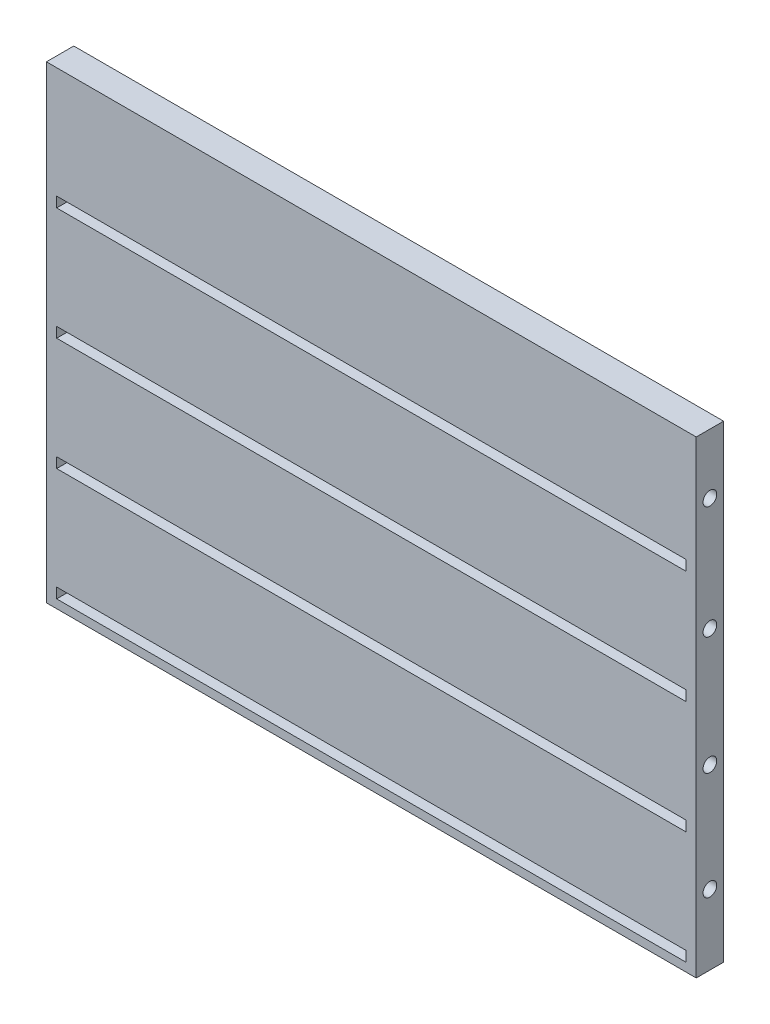
ISO-10303-21;
HEADER;
FILE_DESCRIPTION(('STEP AP214'),'2;1');
FILE_NAME('part.step','',(''),(''),'','','');
FILE_SCHEMA(('AUTOMOTIVE_DESIGN { 1 0 10303 214 1 1 1 1 }'));
ENDSEC;
DATA;
#1=APPLICATION_CONTEXT('core data for automotive mechanical design processes');
#2=APPLICATION_PROTOCOL_DEFINITION('international standard','automotive_design',2000,#1);
#3=PRODUCT_CONTEXT('',#1,'mechanical');
#4=PRODUCT('Part','Part','',(#3));
#5=PRODUCT_RELATED_PRODUCT_CATEGORY('part','',(#4));
#6=PRODUCT_DEFINITION_FORMATION('','',#4);
#7=PRODUCT_DEFINITION_CONTEXT('part definition',#1,'design');
#8=PRODUCT_DEFINITION('design','',#6,#7);
#9=PRODUCT_DEFINITION_SHAPE('','',#8);
#10=(LENGTH_UNIT() NAMED_UNIT(*) SI_UNIT(.MILLI.,.METRE.));
#11=(NAMED_UNIT(*) PLANE_ANGLE_UNIT() SI_UNIT($,.RADIAN.));
#12=(NAMED_UNIT(*) SI_UNIT($,.STERADIAN.) SOLID_ANGLE_UNIT());
#13=UNCERTAINTY_MEASURE_WITH_UNIT(LENGTH_MEASURE(1.E-05),#10,'distance_accuracy_value','');
#14=(GEOMETRIC_REPRESENTATION_CONTEXT(3) GLOBAL_UNCERTAINTY_ASSIGNED_CONTEXT((#13)) GLOBAL_UNIT_ASSIGNED_CONTEXT((#10,
#11,#12)) REPRESENTATION_CONTEXT('',''));
#15=CARTESIAN_POINT('',(0.,0.,0.));
#16=DIRECTION('',(0.,0.,1.));
#17=DIRECTION('',(1.,0.,0.));
#18=AXIS2_PLACEMENT_3D('',#15,#16,#17);
#19=CARTESIAN_POINT('',(0.,0.,3.2));
#20=DIRECTION('',(1.,0.,0.));
#21=DIRECTION('',(0.,1.,0.));
#22=AXIS2_PLACEMENT_3D('',#19,#20,#21);
#23=PLANE('',#22);
#24=DIRECTION('',(0.,-1.,0.));
#25=VECTOR('',#24,1.);
#26=CARTESIAN_POINT('',(0.,0.,0.));
#27=LINE('',#26,#25);
#28=CARTESIAN_POINT('',(0.,0.,0.));
#29=VERTEX_POINT('',#28);
#30=CARTESIAN_POINT('',(0.,-54.8,0.));
#31=VERTEX_POINT('',#30);
#32=EDGE_CURVE('E286',#29,#31,#27,.T.);
#33=ORIENTED_EDGE('',*,*,#32,.T.);
#34=DIRECTION('',(0.,0.,-1.));
#35=VECTOR('',#34,1.);
#36=CARTESIAN_POINT('',(0.,-54.8,3.2));
#37=LINE('',#36,#35);
#38=CARTESIAN_POINT('',(0.,-54.8,3.2));
#39=VERTEX_POINT('',#38);
#40=EDGE_CURVE('E11',#39,#31,#37,.T.);
#41=ORIENTED_EDGE('',*,*,#40,.F.);
#42=DIRECTION('',(0.,-1.,0.));
#43=VECTOR('',#42,1.);
#44=CARTESIAN_POINT('',(0.,0.,3.2));
#45=LINE('',#44,#43);
#46=CARTESIAN_POINT('',(0.,0.,3.2));
#47=VERTEX_POINT('',#46);
#48=EDGE_CURVE('E287',#47,#39,#45,.T.);
#49=ORIENTED_EDGE('',*,*,#48,.F.);
#50=DIRECTION('',(0.,0.,-1.));
#51=VECTOR('',#50,1.);
#52=CARTESIAN_POINT('',(0.,0.,3.2));
#53=LINE('',#52,#51);
#54=EDGE_CURVE('E297',#47,#29,#53,.T.);
#55=ORIENTED_EDGE('',*,*,#54,.T.);
#56=EDGE_LOOP('',(#33,#41,#49,#55));
#57=FACE_BOUND('',#56,.T.);
#58=ADVANCED_FACE('F33',(#57),#23,.F.);
#59=CARTESIAN_POINT('',(0.,-54.8,3.2));
#60=DIRECTION('',(0.,1.,0.));
#61=DIRECTION('',(0.,0.,1.));
#62=AXIS2_PLACEMENT_3D('',#59,#60,#61);
#63=PLANE('',#62);
#64=DIRECTION('',(1.,0.,0.));
#65=VECTOR('',#64,1.);
#66=CARTESIAN_POINT('',(0.,-54.8,0.));
#67=LINE('',#66,#65);
#68=CARTESIAN_POINT('',(76.,-54.8,0.));
#69=VERTEX_POINT('',#68);
#70=EDGE_CURVE('E300',#31,#69,#67,.T.);
#71=ORIENTED_EDGE('',*,*,#70,.T.);
#72=DIRECTION('',(0.,0.,-1.));
#73=VECTOR('',#72,1.);
#74=CARTESIAN_POINT('',(76.,-54.8,3.2));
#75=LINE('',#74,#73);
#76=CARTESIAN_POINT('',(76.,-54.8,3.2));
#77=VERTEX_POINT('',#76);
#78=EDGE_CURVE('E40',#77,#69,#75,.T.);
#79=ORIENTED_EDGE('',*,*,#78,.F.);
#80=DIRECTION('',(1.,0.,0.));
#81=VECTOR('',#80,1.);
#82=CARTESIAN_POINT('',(0.,-54.8,3.2));
#83=LINE('',#82,#81);
#84=EDGE_CURVE('E290',#39,#77,#83,.T.);
#85=ORIENTED_EDGE('',*,*,#84,.F.);
#86=ORIENTED_EDGE('',*,*,#40,.T.);
#87=EDGE_LOOP('',(#71,#79,#85,#86));
#88=FACE_BOUND('',#87,.T.);
#89=ADVANCED_FACE('F330',(#88),#63,.F.);
#90=CARTESIAN_POINT('',(76.,0.,3.2));
#91=DIRECTION('',(-1.,0.,0.));
#92=DIRECTION('',(0.,0.,1.));
#93=AXIS2_PLACEMENT_3D('',#90,#91,#92);
#94=PLANE('',#93);
#95=CARTESIAN_POINT('',(76.,-46.6,1.6));
#96=DIRECTION('',(1.,0.,0.));
#97=DIRECTION('',(0.,0.,-1.));
#98=AXIS2_PLACEMENT_3D('',#95,#96,#97);
#99=CIRCLE('',#98,0.799999999999999);
#100=CARTESIAN_POINT('',(76.,-46.6,0.800000000000001));
#101=VERTEX_POINT('',#100);
#102=EDGE_CURVE('E456',#101,#101,#99,.T.);
#103=ORIENTED_EDGE('',*,*,#102,.F.);
#104=EDGE_LOOP('',(#103));
#105=FACE_BOUND('',#104,.T.);
#106=CARTESIAN_POINT('',(76.,-33.9988678765129,1.6));
#107=DIRECTION('',(1.,0.,0.));
#108=DIRECTION('',(0.,0.,-1.));
#109=AXIS2_PLACEMENT_3D('',#106,#107,#108);
#110=CIRCLE('',#109,0.799999999999999);
#111=CARTESIAN_POINT('',(76.,-33.9988678765129,0.800000000000001));
#112=VERTEX_POINT('',#111);
#113=EDGE_CURVE('E455',#112,#112,#110,.T.);
#114=ORIENTED_EDGE('',*,*,#113,.F.);
#115=EDGE_LOOP('',(#114));
#116=FACE_BOUND('',#115,.T.);
#117=CARTESIAN_POINT('',(76.,-20.2,1.6));
#118=DIRECTION('',(1.,0.,0.));
#119=DIRECTION('',(0.,0.,-1.));
#120=AXIS2_PLACEMENT_3D('',#117,#118,#119);
#121=CIRCLE('',#120,0.800000000000002);
#122=CARTESIAN_POINT('',(76.,-20.2,0.799999999999998));
#123=VERTEX_POINT('',#122);
#124=EDGE_CURVE('E465',#123,#123,#121,.T.);
#125=ORIENTED_EDGE('',*,*,#124,.F.);
#126=EDGE_LOOP('',(#125));
#127=FACE_BOUND('',#126,.T.);
#128=CARTESIAN_POINT('',(76.,-7.,1.6));
#129=DIRECTION('',(1.,0.,0.));
#130=DIRECTION('',(0.,0.,-1.));
#131=AXIS2_PLACEMENT_3D('',#128,#129,#130);
#132=CIRCLE('',#131,0.8);
#133=CARTESIAN_POINT('',(76.,-7.,0.8));
#134=VERTEX_POINT('',#133);
#135=EDGE_CURVE('E470',#134,#134,#132,.T.);
#136=ORIENTED_EDGE('',*,*,#135,.F.);
#137=EDGE_LOOP('',(#136));
#138=FACE_BOUND('',#137,.T.);
#139=DIRECTION('',(0.,1.,0.));
#140=VECTOR('',#139,1.);
#141=CARTESIAN_POINT('',(76.,0.,0.));
#142=LINE('',#141,#140);
#143=CARTESIAN_POINT('',(76.,0.,0.));
#144=VERTEX_POINT('',#143);
#145=EDGE_CURVE('E302',#69,#144,#142,.T.);
#146=ORIENTED_EDGE('',*,*,#145,.T.);
#147=DIRECTION('',(0.,0.,-1.));
#148=VECTOR('',#147,1.);
#149=CARTESIAN_POINT('',(76.,0.,3.2));
#150=LINE('',#149,#148);
#151=CARTESIAN_POINT('',(76.,0.,3.2));
#152=VERTEX_POINT('',#151);
#153=EDGE_CURVE('E307',#152,#144,#150,.T.);
#154=ORIENTED_EDGE('',*,*,#153,.F.);
#155=DIRECTION('',(0.,1.,0.));
#156=VECTOR('',#155,1.);
#157=CARTESIAN_POINT('',(76.,0.,3.2));
#158=LINE('',#157,#156);
#159=EDGE_CURVE('E293',#77,#152,#158,.T.);
#160=ORIENTED_EDGE('',*,*,#159,.F.);
#161=ORIENTED_EDGE('',*,*,#78,.T.);
#162=EDGE_LOOP('',(#146,#154,#160,#161));
#163=FACE_BOUND('',#162,.T.);
#164=ADVANCED_FACE('F314',(#105,#116,#127,#138,#163),#94,.F.);
#165=CARTESIAN_POINT('',(0.,0.,3.2));
#166=DIRECTION('',(0.,-1.,0.));
#167=DIRECTION('',(0.,0.,-1.));
#168=AXIS2_PLACEMENT_3D('',#165,#166,#167);
#169=PLANE('',#168);
#170=DIRECTION('',(-1.,0.,0.));
#171=VECTOR('',#170,1.);
#172=CARTESIAN_POINT('',(0.,0.,0.));
#173=LINE('',#172,#171);
#174=EDGE_CURVE('E291',#144,#29,#173,.T.);
#175=ORIENTED_EDGE('',*,*,#174,.T.);
#176=ORIENTED_EDGE('',*,*,#54,.F.);
#177=DIRECTION('',(-1.,0.,0.));
#178=VECTOR('',#177,1.);
#179=CARTESIAN_POINT('',(0.,0.,3.2));
#180=LINE('',#179,#178);
#181=EDGE_CURVE('E295',#152,#47,#180,.T.);
#182=ORIENTED_EDGE('',*,*,#181,.F.);
#183=ORIENTED_EDGE('',*,*,#153,.T.);
#184=EDGE_LOOP('',(#175,#176,#182,#183));
#185=FACE_BOUND('',#184,.T.);
#186=ADVANCED_FACE('F323',(#185),#169,.F.);
#187=CARTESIAN_POINT('',(0.,0.,3.2));
#188=DIRECTION('',(0.,0.,1.));
#189=DIRECTION('',(1.,0.,0.));
#190=AXIS2_PLACEMENT_3D('',#187,#188,#189);
#191=PLANE('',#190);
#192=DIRECTION('',(0.,-1.,0.));
#193=VECTOR('',#192,1.);
#194=CARTESIAN_POINT('',(74.8,-52.6,3.2));
#195=LINE('',#194,#193);
#196=CARTESIAN_POINT('',(74.8,-52.6,3.2));
#197=VERTEX_POINT('',#196);
#198=CARTESIAN_POINT('',(74.8,-53.8,3.2));
#199=VERTEX_POINT('',#198);
#200=EDGE_CURVE('E175',#197,#199,#195,.T.);
#201=ORIENTED_EDGE('',*,*,#200,.T.);
#202=DIRECTION('',(-1.,0.,0.));
#203=VECTOR('',#202,1.);
#204=CARTESIAN_POINT('',(74.8,-53.8,3.2));
#205=LINE('',#204,#203);
#206=CARTESIAN_POINT('',(1.2,-53.8,3.2));
#207=VERTEX_POINT('',#206);
#208=EDGE_CURVE('E196',#199,#207,#205,.T.);
#209=ORIENTED_EDGE('',*,*,#208,.T.);
#210=DIRECTION('',(0.,-1.,0.));
#211=VECTOR('',#210,1.);
#212=CARTESIAN_POINT('',(1.2,-52.6,3.2));
#213=LINE('',#212,#211);
#214=CARTESIAN_POINT('',(1.2,-52.6,3.2));
#215=VERTEX_POINT('',#214);
#216=EDGE_CURVE('E484',#215,#207,#213,.T.);
#217=ORIENTED_EDGE('',*,*,#216,.F.);
#218=DIRECTION('',(-1.,0.,0.));
#219=VECTOR('',#218,1.);
#220=CARTESIAN_POINT('',(74.8,-52.6,3.2));
#221=LINE('',#220,#219);
#222=EDGE_CURVE('E47',#197,#215,#221,.T.);
#223=ORIENTED_EDGE('',*,*,#222,.F.);
#224=EDGE_LOOP('',(#201,#209,#217,#223));
#225=FACE_BOUND('',#224,.T.);
#226=DIRECTION('',(0.,-1.,0.));
#227=VECTOR('',#226,1.);
#228=CARTESIAN_POINT('',(74.8,-39.4,3.2));
#229=LINE('',#228,#227);
#230=CARTESIAN_POINT('',(74.8,-39.4,3.2));
#231=VERTEX_POINT('',#230);
#232=CARTESIAN_POINT('',(74.8,-40.6,3.2));
#233=VERTEX_POINT('',#232);
#234=EDGE_CURVE('E206',#231,#233,#229,.T.);
#235=ORIENTED_EDGE('',*,*,#234,.T.);
#236=DIRECTION('',(-1.,0.,0.));
#237=VECTOR('',#236,1.);
#238=CARTESIAN_POINT('',(74.8,-40.6,3.2));
#239=LINE('',#238,#237);
#240=CARTESIAN_POINT('',(1.2,-40.6,3.2));
#241=VERTEX_POINT('',#240);
#242=EDGE_CURVE('E218',#233,#241,#239,.T.);
#243=ORIENTED_EDGE('',*,*,#242,.T.);
#244=DIRECTION('',(0.,-1.,0.));
#245=VECTOR('',#244,1.);
#246=CARTESIAN_POINT('',(1.2,-39.4,3.2));
#247=LINE('',#246,#245);
#248=CARTESIAN_POINT('',(1.2,-39.4,3.2));
#249=VERTEX_POINT('',#248);
#250=EDGE_CURVE('E213',#249,#241,#247,.T.);
#251=ORIENTED_EDGE('',*,*,#250,.F.);
#252=DIRECTION('',(-1.,0.,0.));
#253=VECTOR('',#252,1.);
#254=CARTESIAN_POINT('',(74.8,-39.4,3.2));
#255=LINE('',#254,#253);
#256=EDGE_CURVE('E55',#231,#249,#255,.T.);
#257=ORIENTED_EDGE('',*,*,#256,.F.);
#258=EDGE_LOOP('',(#235,#243,#251,#257));
#259=FACE_BOUND('',#258,.T.);
#260=DIRECTION('',(0.,-1.,0.));
#261=VECTOR('',#260,1.);
#262=CARTESIAN_POINT('',(74.8,-26.2,3.2));
#263=LINE('',#262,#261);
#264=CARTESIAN_POINT('',(74.8,-26.2,3.2));
#265=VERTEX_POINT('',#264);
#266=CARTESIAN_POINT('',(74.8,-27.4,3.2));
#267=VERTEX_POINT('',#266);
#268=EDGE_CURVE('E232',#265,#267,#263,.T.);
#269=ORIENTED_EDGE('',*,*,#268,.T.);
#270=DIRECTION('',(-1.,0.,0.));
#271=VECTOR('',#270,1.);
#272=CARTESIAN_POINT('',(74.8,-27.4,3.2));
#273=LINE('',#272,#271);
#274=CARTESIAN_POINT('',(1.2,-27.4,3.2));
#275=VERTEX_POINT('',#274);
#276=EDGE_CURVE('E248',#267,#275,#273,.T.);
#277=ORIENTED_EDGE('',*,*,#276,.T.);
#278=DIRECTION('',(0.,-1.,0.));
#279=VECTOR('',#278,1.);
#280=CARTESIAN_POINT('',(1.2,-26.2,3.2));
#281=LINE('',#280,#279);
#282=CARTESIAN_POINT('',(1.2,-26.2,3.2));
#283=VERTEX_POINT('',#282);
#284=EDGE_CURVE('E243',#283,#275,#281,.T.);
#285=ORIENTED_EDGE('',*,*,#284,.F.);
#286=DIRECTION('',(-1.,0.,0.));
#287=VECTOR('',#286,1.);
#288=CARTESIAN_POINT('',(74.8,-26.2,3.2));
#289=LINE('',#288,#287);
#290=EDGE_CURVE('E251',#265,#283,#289,.T.);
#291=ORIENTED_EDGE('',*,*,#290,.F.);
#292=EDGE_LOOP('',(#269,#277,#285,#291));
#293=FACE_BOUND('',#292,.T.);
#294=DIRECTION('',(0.,-1.,0.));
#295=VECTOR('',#294,1.);
#296=CARTESIAN_POINT('',(74.8,-13.,3.2));
#297=LINE('',#296,#295);
#298=CARTESIAN_POINT('',(74.8,-13.,3.2));
#299=VERTEX_POINT('',#298);
#300=CARTESIAN_POINT('',(74.8,-14.2,3.2));
#301=VERTEX_POINT('',#300);
#302=EDGE_CURVE('E257',#299,#301,#297,.T.);
#303=ORIENTED_EDGE('',*,*,#302,.T.);
#304=DIRECTION('',(-1.,0.,0.));
#305=VECTOR('',#304,1.);
#306=CARTESIAN_POINT('',(74.8,-14.2,3.2));
#307=LINE('',#306,#305);
#308=CARTESIAN_POINT('',(1.2,-14.2,3.2));
#309=VERTEX_POINT('',#308);
#310=EDGE_CURVE('E283',#301,#309,#307,.T.);
#311=ORIENTED_EDGE('',*,*,#310,.T.);
#312=DIRECTION('',(0.,-1.,0.));
#313=VECTOR('',#312,1.);
#314=CARTESIAN_POINT('',(1.2,-13.,3.2));
#315=LINE('',#314,#313);
#316=CARTESIAN_POINT('',(1.2,-13.,3.2));
#317=VERTEX_POINT('',#316);
#318=EDGE_CURVE('E256',#317,#309,#315,.T.);
#319=ORIENTED_EDGE('',*,*,#318,.F.);
#320=DIRECTION('',(-1.,0.,0.));
#321=VECTOR('',#320,1.);
#322=CARTESIAN_POINT('',(74.8,-13.,3.2));
#323=LINE('',#322,#321);
#324=EDGE_CURVE('E267',#299,#317,#323,.T.);
#325=ORIENTED_EDGE('',*,*,#324,.F.);
#326=EDGE_LOOP('',(#303,#311,#319,#325));
#327=FACE_BOUND('',#326,.T.);
#328=ORIENTED_EDGE('',*,*,#48,.T.);
#329=ORIENTED_EDGE('',*,*,#84,.T.);
#330=ORIENTED_EDGE('',*,*,#159,.T.);
#331=ORIENTED_EDGE('',*,*,#181,.T.);
#332=EDGE_LOOP('',(#328,#329,#330,#331));
#333=FACE_BOUND('',#332,.T.);
#334=ADVANCED_FACE('F329',(#225,#259,#293,#327,#333),#191,.T.);
#335=CARTESIAN_POINT('',(0.,0.,0.));
#336=DIRECTION('',(0.,0.,1.));
#337=DIRECTION('',(1.,0.,0.));
#338=AXIS2_PLACEMENT_3D('',#335,#336,#337);
#339=PLANE('',#338);
#340=ORIENTED_EDGE('',*,*,#32,.F.);
#341=ORIENTED_EDGE('',*,*,#174,.F.);
#342=ORIENTED_EDGE('',*,*,#145,.F.);
#343=ORIENTED_EDGE('',*,*,#70,.F.);
#344=EDGE_LOOP('',(#340,#341,#342,#343));
#345=FACE_BOUND('',#344,.T.);
#346=ADVANCED_FACE('F320',(#345),#339,.F.);
#347=CARTESIAN_POINT('',(74.8,-14.2,3.2));
#348=DIRECTION('',(0.,1.,0.));
#349=DIRECTION('',(0.,0.,1.));
#350=AXIS2_PLACEMENT_3D('',#347,#348,#349);
#351=PLANE('',#350);
#352=DIRECTION('',(0.,0.,-1.));
#353=VECTOR('',#352,1.);
#354=CARTESIAN_POINT('',(1.2,-14.2,3.2));
#355=LINE('',#354,#353);
#356=CARTESIAN_POINT('',(1.2,-14.2,2.));
#357=VERTEX_POINT('',#356);
#358=EDGE_CURVE('E270',#309,#357,#355,.T.);
#359=ORIENTED_EDGE('',*,*,#358,.F.);
#360=ORIENTED_EDGE('',*,*,#310,.F.);
#361=DIRECTION('',(0.,0.,-1.));
#362=VECTOR('',#361,1.);
#363=CARTESIAN_POINT('',(74.8,-14.2,3.2));
#364=LINE('',#363,#362);
#365=CARTESIAN_POINT('',(74.8,-14.2,2.));
#366=VERTEX_POINT('',#365);
#367=EDGE_CURVE('E260',#301,#366,#364,.T.);
#368=ORIENTED_EDGE('',*,*,#367,.T.);
#369=DIRECTION('',(-1.,0.,0.));
#370=VECTOR('',#369,1.);
#371=CARTESIAN_POINT('',(74.8,-14.2,2.));
#372=LINE('',#371,#370);
#373=EDGE_CURVE('E280',#366,#357,#372,.T.);
#374=ORIENTED_EDGE('',*,*,#373,.T.);
#375=EDGE_LOOP('',(#359,#360,#368,#374));
#376=FACE_BOUND('',#375,.T.);
#377=ADVANCED_FACE('F343',(#376),#351,.T.);
#378=CARTESIAN_POINT('',(74.8,-13.,2.));
#379=DIRECTION('',(0.,0.,1.));
#380=DIRECTION('',(1.,0.,0.));
#381=AXIS2_PLACEMENT_3D('',#378,#379,#380);
#382=PLANE('',#381);
#383=DIRECTION('',(0.,1.,0.));
#384=VECTOR('',#383,1.);
#385=CARTESIAN_POINT('',(1.2,-13.,2.));
#386=LINE('',#385,#384);
#387=CARTESIAN_POINT('',(1.2,-13.,2.));
#388=VERTEX_POINT('',#387);
#389=EDGE_CURVE('E272',#357,#388,#386,.T.);
#390=ORIENTED_EDGE('',*,*,#389,.F.);
#391=ORIENTED_EDGE('',*,*,#373,.F.);
#392=DIRECTION('',(0.,1.,0.));
#393=VECTOR('',#392,1.);
#394=CARTESIAN_POINT('',(74.8,-13.,2.));
#395=LINE('',#394,#393);
#396=CARTESIAN_POINT('',(74.8,-13.,2.));
#397=VERTEX_POINT('',#396);
#398=EDGE_CURVE('E263',#366,#397,#395,.T.);
#399=ORIENTED_EDGE('',*,*,#398,.T.);
#400=DIRECTION('',(-1.,0.,0.));
#401=VECTOR('',#400,1.);
#402=CARTESIAN_POINT('',(74.8,-13.,2.));
#403=LINE('',#402,#401);
#404=EDGE_CURVE('E277',#397,#388,#403,.T.);
#405=ORIENTED_EDGE('',*,*,#404,.T.);
#406=EDGE_LOOP('',(#390,#391,#399,#405));
#407=FACE_BOUND('',#406,.T.);
#408=ADVANCED_FACE('F349',(#407),#382,.T.);
#409=CARTESIAN_POINT('',(74.8,-13.,3.2));
#410=DIRECTION('',(0.,-1.,0.));
#411=DIRECTION('',(0.,0.,-1.));
#412=AXIS2_PLACEMENT_3D('',#409,#410,#411);
#413=PLANE('',#412);
#414=DIRECTION('',(0.,0.,1.));
#415=VECTOR('',#414,1.);
#416=CARTESIAN_POINT('',(1.2,-13.,3.2));
#417=LINE('',#416,#415);
#418=EDGE_CURVE('E261',#388,#317,#417,.T.);
#419=ORIENTED_EDGE('',*,*,#418,.F.);
#420=ORIENTED_EDGE('',*,*,#404,.F.);
#421=DIRECTION('',(0.,0.,1.));
#422=VECTOR('',#421,1.);
#423=CARTESIAN_POINT('',(74.8,-13.,3.2));
#424=LINE('',#423,#422);
#425=EDGE_CURVE('E265',#397,#299,#424,.T.);
#426=ORIENTED_EDGE('',*,*,#425,.T.);
#427=ORIENTED_EDGE('',*,*,#324,.T.);
#428=EDGE_LOOP('',(#419,#420,#426,#427));
#429=FACE_BOUND('',#428,.T.);
#430=ADVANCED_FACE('F353',(#429),#413,.T.);
#431=CARTESIAN_POINT('',(74.8,0.,0.));
#432=DIRECTION('',(1.,0.,0.));
#433=DIRECTION('',(0.,0.,-1.));
#434=AXIS2_PLACEMENT_3D('',#431,#432,#433);
#435=PLANE('',#434);
#436=ORIENTED_EDGE('',*,*,#302,.F.);
#437=ORIENTED_EDGE('',*,*,#425,.F.);
#438=ORIENTED_EDGE('',*,*,#398,.F.);
#439=ORIENTED_EDGE('',*,*,#367,.F.);
#440=EDGE_LOOP('',(#436,#437,#438,#439));
#441=FACE_BOUND('',#440,.T.);
#442=ADVANCED_FACE('F357',(#441),#435,.F.);
#443=CARTESIAN_POINT('',(1.2,0.,0.));
#444=DIRECTION('',(1.,0.,0.));
#445=DIRECTION('',(0.,0.,-1.));
#446=AXIS2_PLACEMENT_3D('',#443,#444,#445);
#447=PLANE('',#446);
#448=ORIENTED_EDGE('',*,*,#318,.T.);
#449=ORIENTED_EDGE('',*,*,#358,.T.);
#450=ORIENTED_EDGE('',*,*,#389,.T.);
#451=ORIENTED_EDGE('',*,*,#418,.T.);
#452=EDGE_LOOP('',(#448,#449,#450,#451));
#453=FACE_BOUND('',#452,.T.);
#454=ADVANCED_FACE('F359',(#453),#447,.T.);
#455=CARTESIAN_POINT('',(74.8,-26.2,2.));
#456=DIRECTION('',(0.,0.,1.));
#457=DIRECTION('',(1.,0.,0.));
#458=AXIS2_PLACEMENT_3D('',#455,#456,#457);
#459=PLANE('',#458);
#460=DIRECTION('',(0.,1.,0.));
#461=VECTOR('',#460,1.);
#462=CARTESIAN_POINT('',(1.2,-26.2,2.));
#463=LINE('',#462,#461);
#464=CARTESIAN_POINT('',(1.2,-27.4,2.));
#465=VERTEX_POINT('',#464);
#466=CARTESIAN_POINT('',(1.2,-26.2,2.));
#467=VERTEX_POINT('',#466);
#468=EDGE_CURVE('E225',#465,#467,#463,.T.);
#469=ORIENTED_EDGE('',*,*,#468,.F.);
#470=DIRECTION('',(-1.,0.,0.));
#471=VECTOR('',#470,1.);
#472=CARTESIAN_POINT('',(74.8,-27.4,2.));
#473=LINE('',#472,#471);
#474=CARTESIAN_POINT('',(74.8,-27.4,2.));
#475=VERTEX_POINT('',#474);
#476=EDGE_CURVE('E237',#475,#465,#473,.T.);
#477=ORIENTED_EDGE('',*,*,#476,.F.);
#478=DIRECTION('',(0.,1.,0.));
#479=VECTOR('',#478,1.);
#480=CARTESIAN_POINT('',(74.8,-26.2,2.));
#481=LINE('',#480,#479);
#482=CARTESIAN_POINT('',(74.8,-26.2,2.));
#483=VERTEX_POINT('',#482);
#484=EDGE_CURVE('E226',#475,#483,#481,.T.);
#485=ORIENTED_EDGE('',*,*,#484,.T.);
#486=DIRECTION('',(-1.,0.,0.));
#487=VECTOR('',#486,1.);
#488=CARTESIAN_POINT('',(74.8,-26.2,2.));
#489=LINE('',#488,#487);
#490=EDGE_CURVE('E253',#483,#467,#489,.T.);
#491=ORIENTED_EDGE('',*,*,#490,.T.);
#492=EDGE_LOOP('',(#469,#477,#485,#491));
#493=FACE_BOUND('',#492,.T.);
#494=ADVANCED_FACE('F362',(#493),#459,.T.);
#495=CARTESIAN_POINT('',(74.8,-26.2,3.2));
#496=DIRECTION('',(0.,-1.,0.));
#497=DIRECTION('',(0.,0.,-1.));
#498=AXIS2_PLACEMENT_3D('',#495,#496,#497);
#499=PLANE('',#498);
#500=DIRECTION('',(0.,0.,1.));
#501=VECTOR('',#500,1.);
#502=CARTESIAN_POINT('',(1.2,-26.2,3.2));
#503=LINE('',#502,#501);
#504=EDGE_CURVE('E240',#467,#283,#503,.T.);
#505=ORIENTED_EDGE('',*,*,#504,.F.);
#506=ORIENTED_EDGE('',*,*,#490,.F.);
#507=DIRECTION('',(0.,0.,1.));
#508=VECTOR('',#507,1.);
#509=CARTESIAN_POINT('',(74.8,-26.2,3.2));
#510=LINE('',#509,#508);
#511=EDGE_CURVE('E229',#483,#265,#510,.T.);
#512=ORIENTED_EDGE('',*,*,#511,.T.);
#513=ORIENTED_EDGE('',*,*,#290,.T.);
#514=EDGE_LOOP('',(#505,#506,#512,#513));
#515=FACE_BOUND('',#514,.T.);
#516=ADVANCED_FACE('F369',(#515),#499,.T.);
#517=CARTESIAN_POINT('',(74.8,-27.4,3.2));
#518=DIRECTION('',(0.,1.,0.));
#519=DIRECTION('',(0.,0.,1.));
#520=AXIS2_PLACEMENT_3D('',#517,#518,#519);
#521=PLANE('',#520);
#522=DIRECTION('',(0.,0.,-1.));
#523=VECTOR('',#522,1.);
#524=CARTESIAN_POINT('',(1.2,-27.4,3.2));
#525=LINE('',#524,#523);
#526=EDGE_CURVE('E230',#275,#465,#525,.T.);
#527=ORIENTED_EDGE('',*,*,#526,.F.);
#528=ORIENTED_EDGE('',*,*,#276,.F.);
#529=DIRECTION('',(0.,0.,-1.));
#530=VECTOR('',#529,1.);
#531=CARTESIAN_POINT('',(74.8,-27.4,3.2));
#532=LINE('',#531,#530);
#533=EDGE_CURVE('E235',#267,#475,#532,.T.);
#534=ORIENTED_EDGE('',*,*,#533,.T.);
#535=ORIENTED_EDGE('',*,*,#476,.T.);
#536=EDGE_LOOP('',(#527,#528,#534,#535));
#537=FACE_BOUND('',#536,.T.);
#538=ADVANCED_FACE('F373',(#537),#521,.T.);
#539=CARTESIAN_POINT('',(74.8,0.,0.));
#540=DIRECTION('',(1.,0.,0.));
#541=DIRECTION('',(0.,0.,-1.));
#542=AXIS2_PLACEMENT_3D('',#539,#540,#541);
#543=PLANE('',#542);
#544=ORIENTED_EDGE('',*,*,#484,.F.);
#545=ORIENTED_EDGE('',*,*,#533,.F.);
#546=ORIENTED_EDGE('',*,*,#268,.F.);
#547=ORIENTED_EDGE('',*,*,#511,.F.);
#548=EDGE_LOOP('',(#544,#545,#546,#547));
#549=FACE_BOUND('',#548,.T.);
#550=ADVANCED_FACE('F377',(#549),#543,.F.);
#551=CARTESIAN_POINT('',(1.2,0.,0.));
#552=DIRECTION('',(1.,0.,0.));
#553=DIRECTION('',(0.,0.,-1.));
#554=AXIS2_PLACEMENT_3D('',#551,#552,#553);
#555=PLANE('',#554);
#556=ORIENTED_EDGE('',*,*,#468,.T.);
#557=ORIENTED_EDGE('',*,*,#504,.T.);
#558=ORIENTED_EDGE('',*,*,#284,.T.);
#559=ORIENTED_EDGE('',*,*,#526,.T.);
#560=EDGE_LOOP('',(#556,#557,#558,#559));
#561=FACE_BOUND('',#560,.T.);
#562=ADVANCED_FACE('F379',(#561),#555,.T.);
#563=CARTESIAN_POINT('',(74.8,-39.4,2.));
#564=DIRECTION('',(0.,0.,1.));
#565=DIRECTION('',(1.,0.,0.));
#566=AXIS2_PLACEMENT_3D('',#563,#564,#565);
#567=PLANE('',#566);
#568=DIRECTION('',(0.,1.,0.));
#569=VECTOR('',#568,1.);
#570=CARTESIAN_POINT('',(1.2,-39.4,2.));
#571=LINE('',#570,#569);
#572=CARTESIAN_POINT('',(1.2,-40.6,2.));
#573=VERTEX_POINT('',#572);
#574=CARTESIAN_POINT('',(1.2,-39.4,2.));
#575=VERTEX_POINT('',#574);
#576=EDGE_CURVE('E191',#573,#575,#571,.T.);
#577=ORIENTED_EDGE('',*,*,#576,.F.);
#578=DIRECTION('',(-1.,0.,0.));
#579=VECTOR('',#578,1.);
#580=CARTESIAN_POINT('',(74.8,-40.6,2.));
#581=LINE('',#580,#579);
#582=CARTESIAN_POINT('',(74.8,-40.6,2.));
#583=VERTEX_POINT('',#582);
#584=EDGE_CURVE('E210',#583,#573,#581,.T.);
#585=ORIENTED_EDGE('',*,*,#584,.F.);
#586=DIRECTION('',(0.,1.,0.));
#587=VECTOR('',#586,1.);
#588=CARTESIAN_POINT('',(74.8,-39.4,2.));
#589=LINE('',#588,#587);
#590=CARTESIAN_POINT('',(74.8,-39.4,2.));
#591=VERTEX_POINT('',#590);
#592=EDGE_CURVE('E200',#583,#591,#589,.T.);
#593=ORIENTED_EDGE('',*,*,#592,.T.);
#594=DIRECTION('',(-1.,0.,0.));
#595=VECTOR('',#594,1.);
#596=CARTESIAN_POINT('',(74.8,-39.4,2.));
#597=LINE('',#596,#595);
#598=EDGE_CURVE('E222',#591,#575,#597,.T.);
#599=ORIENTED_EDGE('',*,*,#598,.T.);
#600=EDGE_LOOP('',(#577,#585,#593,#599));
#601=FACE_BOUND('',#600,.T.);
#602=ADVANCED_FACE('F382',(#601),#567,.T.);
#603=CARTESIAN_POINT('',(74.8,-39.4,3.2));
#604=DIRECTION('',(0.,-1.,0.));
#605=DIRECTION('',(0.,0.,-1.));
#606=AXIS2_PLACEMENT_3D('',#603,#604,#605);
#607=PLANE('',#606);
#608=DIRECTION('',(0.,0.,1.));
#609=VECTOR('',#608,1.);
#610=CARTESIAN_POINT('',(1.2,-39.4,3.2));
#611=LINE('',#610,#609);
#612=EDGE_CURVE('E194',#575,#249,#611,.T.);
#613=ORIENTED_EDGE('',*,*,#612,.F.);
#614=ORIENTED_EDGE('',*,*,#598,.F.);
#615=DIRECTION('',(0.,0.,1.));
#616=VECTOR('',#615,1.);
#617=CARTESIAN_POINT('',(74.8,-39.4,3.2));
#618=LINE('',#617,#616);
#619=EDGE_CURVE('E203',#591,#231,#618,.T.);
#620=ORIENTED_EDGE('',*,*,#619,.T.);
#621=ORIENTED_EDGE('',*,*,#256,.T.);
#622=EDGE_LOOP('',(#613,#614,#620,#621));
#623=FACE_BOUND('',#622,.T.);
#624=ADVANCED_FACE('F389',(#623),#607,.T.);
#625=CARTESIAN_POINT('',(74.8,-40.6,3.2));
#626=DIRECTION('',(0.,1.,0.));
#627=DIRECTION('',(0.,0.,1.));
#628=AXIS2_PLACEMENT_3D('',#625,#626,#627);
#629=PLANE('',#628);
#630=DIRECTION('',(0.,0.,-1.));
#631=VECTOR('',#630,1.);
#632=CARTESIAN_POINT('',(1.2,-40.6,3.2));
#633=LINE('',#632,#631);
#634=EDGE_CURVE('E204',#241,#573,#633,.T.);
#635=ORIENTED_EDGE('',*,*,#634,.F.);
#636=ORIENTED_EDGE('',*,*,#242,.F.);
#637=DIRECTION('',(0.,0.,-1.));
#638=VECTOR('',#637,1.);
#639=CARTESIAN_POINT('',(74.8,-40.6,3.2));
#640=LINE('',#639,#638);
#641=EDGE_CURVE('E209',#233,#583,#640,.T.);
#642=ORIENTED_EDGE('',*,*,#641,.T.);
#643=ORIENTED_EDGE('',*,*,#584,.T.);
#644=EDGE_LOOP('',(#635,#636,#642,#643));
#645=FACE_BOUND('',#644,.T.);
#646=ADVANCED_FACE('F393',(#645),#629,.T.);
#647=CARTESIAN_POINT('',(74.8,0.,0.));
#648=DIRECTION('',(1.,0.,0.));
#649=DIRECTION('',(0.,0.,-1.));
#650=AXIS2_PLACEMENT_3D('',#647,#648,#649);
#651=PLANE('',#650);
#652=ORIENTED_EDGE('',*,*,#592,.F.);
#653=ORIENTED_EDGE('',*,*,#641,.F.);
#654=ORIENTED_EDGE('',*,*,#234,.F.);
#655=ORIENTED_EDGE('',*,*,#619,.F.);
#656=EDGE_LOOP('',(#652,#653,#654,#655));
#657=FACE_BOUND('',#656,.T.);
#658=ADVANCED_FACE('F396',(#657),#651,.F.);
#659=CARTESIAN_POINT('',(1.2,0.,0.));
#660=DIRECTION('',(1.,0.,0.));
#661=DIRECTION('',(0.,0.,-1.));
#662=AXIS2_PLACEMENT_3D('',#659,#660,#661);
#663=PLANE('',#662);
#664=ORIENTED_EDGE('',*,*,#576,.T.);
#665=ORIENTED_EDGE('',*,*,#612,.T.);
#666=ORIENTED_EDGE('',*,*,#250,.T.);
#667=ORIENTED_EDGE('',*,*,#634,.T.);
#668=EDGE_LOOP('',(#664,#665,#666,#667));
#669=FACE_BOUND('',#668,.T.);
#670=ADVANCED_FACE('F398',(#669),#663,.T.);
#671=CARTESIAN_POINT('',(74.8,-52.6,2.));
#672=DIRECTION('',(0.,0.,1.));
#673=DIRECTION('',(1.,0.,0.));
#674=AXIS2_PLACEMENT_3D('',#671,#672,#673);
#675=PLANE('',#674);
#676=DIRECTION('',(0.,1.,0.));
#677=VECTOR('',#676,1.);
#678=CARTESIAN_POINT('',(1.2,-52.6,2.));
#679=LINE('',#678,#677);
#680=CARTESIAN_POINT('',(1.2,-53.8,2.));
#681=VERTEX_POINT('',#680);
#682=CARTESIAN_POINT('',(1.2,-52.6,2.));
#683=VERTEX_POINT('',#682);
#684=EDGE_CURVE('E476',#681,#683,#679,.T.);
#685=ORIENTED_EDGE('',*,*,#684,.F.);
#686=DIRECTION('',(-1.,0.,0.));
#687=VECTOR('',#686,1.);
#688=CARTESIAN_POINT('',(74.8,-53.8,2.));
#689=LINE('',#688,#687);
#690=CARTESIAN_POINT('',(74.8,-53.8,2.));
#691=VERTEX_POINT('',#690);
#692=EDGE_CURVE('E186',#691,#681,#689,.T.);
#693=ORIENTED_EDGE('',*,*,#692,.F.);
#694=DIRECTION('',(0.,1.,0.));
#695=VECTOR('',#694,1.);
#696=CARTESIAN_POINT('',(74.8,-52.6,2.));
#697=LINE('',#696,#695);
#698=CARTESIAN_POINT('',(74.8,-52.6,2.));
#699=VERTEX_POINT('',#698);
#700=EDGE_CURVE('E173',#691,#699,#697,.T.);
#701=ORIENTED_EDGE('',*,*,#700,.T.);
#702=DIRECTION('',(-1.,0.,0.));
#703=VECTOR('',#702,1.);
#704=CARTESIAN_POINT('',(74.8,-52.6,2.));
#705=LINE('',#704,#703);
#706=EDGE_CURVE('E183',#699,#683,#705,.T.);
#707=ORIENTED_EDGE('',*,*,#706,.T.);
#708=EDGE_LOOP('',(#685,#693,#701,#707));
#709=FACE_BOUND('',#708,.T.);
#710=ADVANCED_FACE('F182',(#709),#675,.T.);
#711=CARTESIAN_POINT('',(74.8,-52.6,3.2));
#712=DIRECTION('',(0.,-1.,0.));
#713=DIRECTION('',(0.,0.,-1.));
#714=AXIS2_PLACEMENT_3D('',#711,#712,#713);
#715=PLANE('',#714);
#716=DIRECTION('',(0.,0.,1.));
#717=VECTOR('',#716,1.);
#718=CARTESIAN_POINT('',(1.2,-52.6,3.2));
#719=LINE('',#718,#717);
#720=EDGE_CURVE('E190',#683,#215,#719,.T.);
#721=ORIENTED_EDGE('',*,*,#720,.F.);
#722=ORIENTED_EDGE('',*,*,#706,.F.);
#723=DIRECTION('',(0.,0.,1.));
#724=VECTOR('',#723,1.);
#725=CARTESIAN_POINT('',(74.8,-52.6,3.2));
#726=LINE('',#725,#724);
#727=EDGE_CURVE('E169',#699,#197,#726,.T.);
#728=ORIENTED_EDGE('',*,*,#727,.T.);
#729=ORIENTED_EDGE('',*,*,#222,.T.);
#730=EDGE_LOOP('',(#721,#722,#728,#729));
#731=FACE_BOUND('',#730,.T.);
#732=ADVANCED_FACE('F189',(#731),#715,.T.);
#733=CARTESIAN_POINT('',(74.8,-53.8,3.2));
#734=DIRECTION('',(0.,1.,0.));
#735=DIRECTION('',(0.,0.,1.));
#736=AXIS2_PLACEMENT_3D('',#733,#734,#735);
#737=PLANE('',#736);
#738=DIRECTION('',(0.,0.,-1.));
#739=VECTOR('',#738,1.);
#740=CARTESIAN_POINT('',(1.2,-53.8,3.2));
#741=LINE('',#740,#739);
#742=EDGE_CURVE('E187',#207,#681,#741,.T.);
#743=ORIENTED_EDGE('',*,*,#742,.F.);
#744=ORIENTED_EDGE('',*,*,#208,.F.);
#745=DIRECTION('',(0.,0.,-1.));
#746=VECTOR('',#745,1.);
#747=CARTESIAN_POINT('',(74.8,-53.8,3.2));
#748=LINE('',#747,#746);
#749=EDGE_CURVE('E480',#199,#691,#748,.T.);
#750=ORIENTED_EDGE('',*,*,#749,.T.);
#751=ORIENTED_EDGE('',*,*,#692,.T.);
#752=EDGE_LOOP('',(#743,#744,#750,#751));
#753=FACE_BOUND('',#752,.T.);
#754=ADVANCED_FACE('F409',(#753),#737,.T.);
#755=CARTESIAN_POINT('',(74.8,0.,0.));
#756=DIRECTION('',(1.,0.,0.));
#757=DIRECTION('',(0.,0.,-1.));
#758=AXIS2_PLACEMENT_3D('',#755,#756,#757);
#759=PLANE('',#758);
#760=ORIENTED_EDGE('',*,*,#700,.F.);
#761=ORIENTED_EDGE('',*,*,#749,.F.);
#762=ORIENTED_EDGE('',*,*,#200,.F.);
#763=ORIENTED_EDGE('',*,*,#727,.F.);
#764=EDGE_LOOP('',(#760,#761,#762,#763));
#765=FACE_BOUND('',#764,.T.);
#766=ADVANCED_FACE('F171',(#765),#759,.F.);
#767=CARTESIAN_POINT('',(1.2,0.,0.));
#768=DIRECTION('',(1.,0.,0.));
#769=DIRECTION('',(0.,0.,-1.));
#770=AXIS2_PLACEMENT_3D('',#767,#768,#769);
#771=PLANE('',#770);
#772=ORIENTED_EDGE('',*,*,#684,.T.);
#773=ORIENTED_EDGE('',*,*,#720,.T.);
#774=ORIENTED_EDGE('',*,*,#216,.T.);
#775=ORIENTED_EDGE('',*,*,#742,.T.);
#776=EDGE_LOOP('',(#772,#773,#774,#775));
#777=FACE_BOUND('',#776,.T.);
#778=ADVANCED_FACE('F413',(#777),#771,.T.);
#779=CARTESIAN_POINT('',(66.,-7.,1.6));
#780=DIRECTION('',(1.,0.,0.));
#781=DIRECTION('',(0.,0.,-1.));
#782=AXIS2_PLACEMENT_3D('',#779,#780,#781);
#783=CYLINDRICAL_SURFACE('',#782,0.8);
#784=CARTESIAN_POINT('',(66.,-7.,1.6));
#785=DIRECTION('',(1.,0.,0.));
#786=DIRECTION('',(0.,0.,-1.));
#787=AXIS2_PLACEMENT_3D('',#784,#785,#786);
#788=CIRCLE('',#787,0.8);
#789=CARTESIAN_POINT('',(66.,-7.,0.8));
#790=VERTEX_POINT('',#789);
#791=EDGE_CURVE('E473',#790,#790,#788,.T.);
#792=ORIENTED_EDGE('',*,*,#791,.F.);
#793=EDGE_LOOP('',(#792));
#794=FACE_BOUND('',#793,.T.);
#795=ORIENTED_EDGE('',*,*,#135,.T.);
#796=EDGE_LOOP('',(#795));
#797=FACE_BOUND('',#796,.T.);
#798=ADVANCED_FACE('F416',(#794,#797),#783,.F.);
#799=CARTESIAN_POINT('',(66.,-7.,1.6));
#800=DIRECTION('',(1.,0.,0.));
#801=DIRECTION('',(0.,0.,-1.));
#802=AXIS2_PLACEMENT_3D('',#799,#800,#801);
#803=PLANE('',#802);
#804=ORIENTED_EDGE('',*,*,#791,.T.);
#805=EDGE_LOOP('',(#804));
#806=FACE_BOUND('',#805,.T.);
#807=ADVANCED_FACE('F422',(#806),#803,.T.);
#808=CARTESIAN_POINT('',(66.,-20.2,1.6));
#809=DIRECTION('',(1.,0.,0.));
#810=DIRECTION('',(0.,0.,-1.));
#811=AXIS2_PLACEMENT_3D('',#808,#809,#810);
#812=CYLINDRICAL_SURFACE('',#811,0.800000000000002);
#813=CARTESIAN_POINT('',(66.,-20.2,1.6));
#814=DIRECTION('',(1.,0.,0.));
#815=DIRECTION('',(0.,0.,-1.));
#816=AXIS2_PLACEMENT_3D('',#813,#814,#815);
#817=CIRCLE('',#816,0.800000000000002);
#818=CARTESIAN_POINT('',(66.,-20.2,0.799999999999998));
#819=VERTEX_POINT('',#818);
#820=EDGE_CURVE('E467',#819,#819,#817,.T.);
#821=ORIENTED_EDGE('',*,*,#820,.F.);
#822=EDGE_LOOP('',(#821));
#823=FACE_BOUND('',#822,.T.);
#824=ORIENTED_EDGE('',*,*,#124,.T.);
#825=EDGE_LOOP('',(#824));
#826=FACE_BOUND('',#825,.T.);
#827=ADVANCED_FACE('F426',(#823,#826),#812,.F.);
#828=CARTESIAN_POINT('',(66.,-20.2,1.6));
#829=DIRECTION('',(1.,0.,0.));
#830=DIRECTION('',(0.,0.,-1.));
#831=AXIS2_PLACEMENT_3D('',#828,#829,#830);
#832=PLANE('',#831);
#833=ORIENTED_EDGE('',*,*,#820,.T.);
#834=EDGE_LOOP('',(#833));
#835=FACE_BOUND('',#834,.T.);
#836=ADVANCED_FACE('F430',(#835),#832,.T.);
#837=CARTESIAN_POINT('',(66.,-33.9988678765129,1.6));
#838=DIRECTION('',(1.,0.,0.));
#839=DIRECTION('',(0.,0.,-1.));
#840=AXIS2_PLACEMENT_3D('',#837,#838,#839);
#841=CYLINDRICAL_SURFACE('',#840,0.799999999999999);
#842=CARTESIAN_POINT('',(66.,-33.9988678765129,1.6));
#843=DIRECTION('',(1.,0.,0.));
#844=DIRECTION('',(0.,0.,-1.));
#845=AXIS2_PLACEMENT_3D('',#842,#843,#844);
#846=CIRCLE('',#845,0.799999999999999);
#847=CARTESIAN_POINT('',(66.,-33.9988678765129,0.800000000000001));
#848=VERTEX_POINT('',#847);
#849=EDGE_CURVE('E459',#848,#848,#846,.T.);
#850=ORIENTED_EDGE('',*,*,#849,.F.);
#851=EDGE_LOOP('',(#850));
#852=FACE_BOUND('',#851,.T.);
#853=ORIENTED_EDGE('',*,*,#113,.T.);
#854=EDGE_LOOP('',(#853));
#855=FACE_BOUND('',#854,.T.);
#856=ADVANCED_FACE('F434',(#852,#855),#841,.F.);
#857=CARTESIAN_POINT('',(66.,-33.9988678765129,1.6));
#858=DIRECTION('',(1.,0.,0.));
#859=DIRECTION('',(0.,0.,-1.));
#860=AXIS2_PLACEMENT_3D('',#857,#858,#859);
#861=PLANE('',#860);
#862=ORIENTED_EDGE('',*,*,#849,.T.);
#863=EDGE_LOOP('',(#862));
#864=FACE_BOUND('',#863,.T.);
#865=ADVANCED_FACE('F438',(#864),#861,.T.);
#866=CARTESIAN_POINT('',(66.,-46.6,1.6));
#867=DIRECTION('',(1.,0.,0.));
#868=DIRECTION('',(0.,0.,-1.));
#869=AXIS2_PLACEMENT_3D('',#866,#867,#868);
#870=CYLINDRICAL_SURFACE('',#869,0.799999999999999);
#871=CARTESIAN_POINT('',(66.,-46.6,1.6));
#872=DIRECTION('',(1.,0.,0.));
#873=DIRECTION('',(0.,0.,-1.));
#874=AXIS2_PLACEMENT_3D('',#871,#872,#873);
#875=CIRCLE('',#874,0.799999999999999);
#876=CARTESIAN_POINT('',(66.,-46.6,0.800000000000001));
#877=VERTEX_POINT('',#876);
#878=EDGE_CURVE('E454',#877,#877,#875,.T.);
#879=ORIENTED_EDGE('',*,*,#878,.F.);
#880=EDGE_LOOP('',(#879));
#881=FACE_BOUND('',#880,.T.);
#882=ORIENTED_EDGE('',*,*,#102,.T.);
#883=EDGE_LOOP('',(#882));
#884=FACE_BOUND('',#883,.T.);
#885=ADVANCED_FACE('F442',(#881,#884),#870,.F.);
#886=CARTESIAN_POINT('',(66.,-46.6,1.6));
#887=DIRECTION('',(1.,0.,0.));
#888=DIRECTION('',(0.,0.,-1.));
#889=AXIS2_PLACEMENT_3D('',#886,#887,#888);
#890=PLANE('',#889);
#891=ORIENTED_EDGE('',*,*,#878,.T.);
#892=EDGE_LOOP('',(#891));
#893=FACE_BOUND('',#892,.T.);
#894=ADVANCED_FACE('F446',(#893),#890,.T.);
#895=CLOSED_SHELL('',(#58,#89,#164,#186,#334,#346,#377,#408,#430,#442,#454,#494,#516,#538,#550,
#562,#602,#624,#646,#658,#670,#710,#732,#754,#766,#778,#798,#807,#827,#836,#856,#865,#885,#894));
#896=MANIFOLD_SOLID_BREP('B2',#895);
#897=ADVANCED_BREP_SHAPE_REPRESENTATION('',(#18,#896),#14);
#898=SHAPE_DEFINITION_REPRESENTATION(#9,#897);
ENDSEC;
END-ISO-10303-21;
